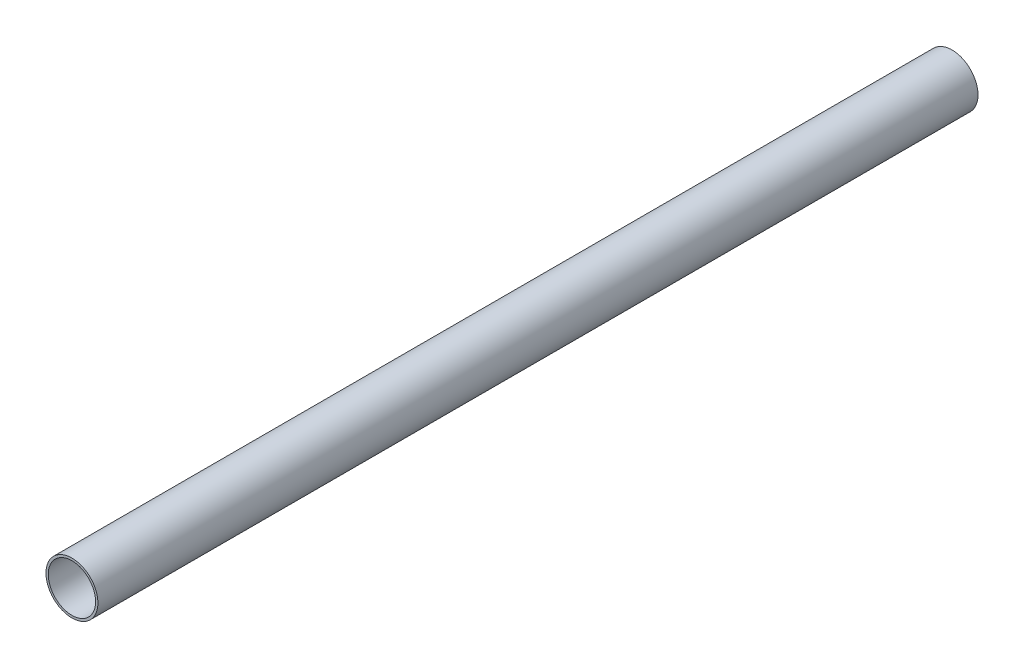
ISO-10303-21;
HEADER;
FILE_DESCRIPTION(('STEP AP214'),'2;1');
FILE_NAME('part.step','',(''),(''),'','','');
FILE_SCHEMA(('AUTOMOTIVE_DESIGN { 1 0 10303 214 1 1 1 1 }'));
ENDSEC;
DATA;
#1=APPLICATION_CONTEXT('core data for automotive mechanical design processes');
#2=APPLICATION_PROTOCOL_DEFINITION('international standard','automotive_design',2000,#1);
#3=PRODUCT_CONTEXT('',#1,'mechanical');
#4=PRODUCT('Part','Part','',(#3));
#5=PRODUCT_RELATED_PRODUCT_CATEGORY('part','',(#4));
#6=PRODUCT_DEFINITION_FORMATION('','',#4);
#7=PRODUCT_DEFINITION_CONTEXT('part definition',#1,'design');
#8=PRODUCT_DEFINITION('design','',#6,#7);
#9=PRODUCT_DEFINITION_SHAPE('','',#8);
#10=(LENGTH_UNIT() NAMED_UNIT(*) SI_UNIT(.MILLI.,.METRE.));
#11=(NAMED_UNIT(*) PLANE_ANGLE_UNIT() SI_UNIT($,.RADIAN.));
#12=(NAMED_UNIT(*) SI_UNIT($,.STERADIAN.) SOLID_ANGLE_UNIT());
#13=UNCERTAINTY_MEASURE_WITH_UNIT(LENGTH_MEASURE(1.E-05),#10,'distance_accuracy_value','');
#14=(GEOMETRIC_REPRESENTATION_CONTEXT(3) GLOBAL_UNCERTAINTY_ASSIGNED_CONTEXT((#13)) GLOBAL_UNIT_ASSIGNED_CONTEXT((#10,
#11,#12)) REPRESENTATION_CONTEXT('',''));
#15=CARTESIAN_POINT('',(0.,0.,0.));
#16=DIRECTION('',(0.,0.,1.));
#17=DIRECTION('',(1.,0.,0.));
#18=AXIS2_PLACEMENT_3D('',#15,#16,#17);
#19=CARTESIAN_POINT('',(0.,0.,5486.4));
#20=DIRECTION('',(0.,0.,1.));
#21=DIRECTION('',(1.,0.,0.));
#22=AXIS2_PLACEMENT_3D('',#19,#20,#21);
#23=PLANE('',#22);
#24=CARTESIAN_POINT('',(0.,0.,5486.4));
#25=DIRECTION('',(0.,0.,1.));
#26=DIRECTION('',(1.,0.,0.));
#27=AXIS2_PLACEMENT_3D('',#24,#25,#26);
#28=CIRCLE('',#27,161.925);
#29=CARTESIAN_POINT('',(161.925,0.,5486.4));
#30=VERTEX_POINT('',#29);
#31=EDGE_CURVE('E10',#30,#30,#28,.T.);
#32=ORIENTED_EDGE('',*,*,#31,.T.);
#33=EDGE_LOOP('',(#32));
#34=FACE_BOUND('',#33,.T.);
#35=CARTESIAN_POINT('',(0.,0.,5486.4));
#36=DIRECTION('',(0.,0.,1.));
#37=DIRECTION('',(1.,0.,0.));
#38=AXIS2_PLACEMENT_3D('',#35,#36,#37);
#39=CIRCLE('',#38,147.6502);
#40=CARTESIAN_POINT('',(147.6502,0.,5486.4));
#41=VERTEX_POINT('',#40);
#42=EDGE_CURVE('E39',#41,#41,#39,.T.);
#43=ORIENTED_EDGE('',*,*,#42,.F.);
#44=EDGE_LOOP('',(#43));
#45=FACE_BOUND('',#44,.T.);
#46=ADVANCED_FACE('F28',(#34,#45),#23,.T.);
#47=CARTESIAN_POINT('',(0.,0.,0.));
#48=DIRECTION('',(0.,0.,1.));
#49=DIRECTION('',(1.,0.,0.));
#50=AXIS2_PLACEMENT_3D('',#47,#48,#49);
#51=PLANE('',#50);
#52=CARTESIAN_POINT('',(0.,0.,0.));
#53=DIRECTION('',(0.,0.,1.));
#54=DIRECTION('',(1.,0.,0.));
#55=AXIS2_PLACEMENT_3D('',#52,#53,#54);
#56=CIRCLE('',#55,161.925);
#57=CARTESIAN_POINT('',(161.925,0.,0.));
#58=VERTEX_POINT('',#57);
#59=EDGE_CURVE('E32',#58,#58,#56,.T.);
#60=ORIENTED_EDGE('',*,*,#59,.F.);
#61=EDGE_LOOP('',(#60));
#62=FACE_BOUND('',#61,.T.);
#63=CARTESIAN_POINT('',(0.,0.,0.));
#64=DIRECTION('',(0.,0.,1.));
#65=DIRECTION('',(1.,0.,0.));
#66=AXIS2_PLACEMENT_3D('',#63,#64,#65);
#67=CIRCLE('',#66,147.6502);
#68=CARTESIAN_POINT('',(147.6502,0.,0.));
#69=VERTEX_POINT('',#68);
#70=EDGE_CURVE('E41',#69,#69,#67,.T.);
#71=ORIENTED_EDGE('',*,*,#70,.T.);
#72=EDGE_LOOP('',(#71));
#73=FACE_BOUND('',#72,.T.);
#74=ADVANCED_FACE('F51',(#62,#73),#51,.F.);
#75=CARTESIAN_POINT('',(0.,0.,5486.4));
#76=DIRECTION('',(0.,0.,-1.));
#77=DIRECTION('',(-1.,0.,0.));
#78=AXIS2_PLACEMENT_3D('',#75,#76,#77);
#79=CYLINDRICAL_SURFACE('',#78,161.925);
#80=ORIENTED_EDGE('',*,*,#31,.F.);
#81=EDGE_LOOP('',(#80));
#82=FACE_BOUND('',#81,.T.);
#83=ORIENTED_EDGE('',*,*,#59,.T.);
#84=EDGE_LOOP('',(#83));
#85=FACE_BOUND('',#84,.T.);
#86=ADVANCED_FACE('F30',(#82,#85),#79,.T.);
#87=CARTESIAN_POINT('',(0.,0.,5486.4));
#88=DIRECTION('',(0.,0.,-1.));
#89=DIRECTION('',(-1.,0.,0.));
#90=AXIS2_PLACEMENT_3D('',#87,#88,#89);
#91=CYLINDRICAL_SURFACE('',#90,147.6502);
#92=ORIENTED_EDGE('',*,*,#42,.T.);
#93=EDGE_LOOP('',(#92));
#94=FACE_BOUND('',#93,.T.);
#95=ORIENTED_EDGE('',*,*,#70,.F.);
#96=EDGE_LOOP('',(#95));
#97=FACE_BOUND('',#96,.T.);
#98=ADVANCED_FACE('F47',(#94,#97),#91,.F.);
#99=CLOSED_SHELL('',(#46,#74,#86,#98));
#100=MANIFOLD_SOLID_BREP('B2',#99);
#101=ADVANCED_BREP_SHAPE_REPRESENTATION('',(#18,#100),#14);
#102=SHAPE_DEFINITION_REPRESENTATION(#9,#101);
ENDSEC;
END-ISO-10303-21;
